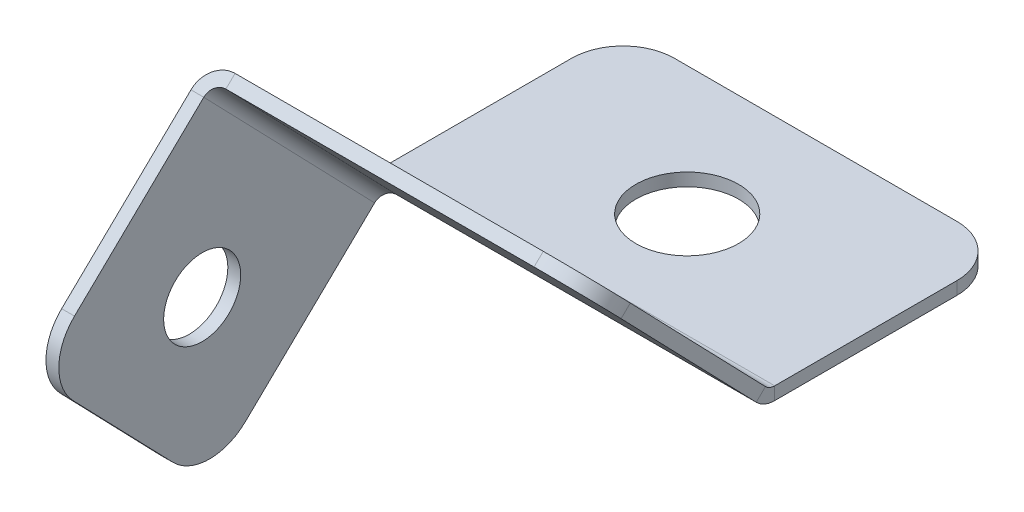
ISO-10303-21;
HEADER;
FILE_DESCRIPTION(('STEP AP214'),'2;1');
FILE_NAME('part.step','',(''),(''),'','','');
FILE_SCHEMA(('AUTOMOTIVE_DESIGN { 1 0 10303 214 1 1 1 1 }'));
ENDSEC;
DATA;
#1=APPLICATION_CONTEXT('core data for automotive mechanical design processes');
#2=APPLICATION_PROTOCOL_DEFINITION('international standard','automotive_design',2000,#1);
#3=PRODUCT_CONTEXT('',#1,'mechanical');
#4=PRODUCT('Part','Part','',(#3));
#5=PRODUCT_RELATED_PRODUCT_CATEGORY('part','',(#4));
#6=PRODUCT_DEFINITION_FORMATION('','',#4);
#7=PRODUCT_DEFINITION_CONTEXT('part definition',#1,'design');
#8=PRODUCT_DEFINITION('design','',#6,#7);
#9=PRODUCT_DEFINITION_SHAPE('','',#8);
#10=(LENGTH_UNIT() NAMED_UNIT(*) SI_UNIT(.MILLI.,.METRE.));
#11=(NAMED_UNIT(*) PLANE_ANGLE_UNIT() SI_UNIT($,.RADIAN.));
#12=(NAMED_UNIT(*) SI_UNIT($,.STERADIAN.) SOLID_ANGLE_UNIT());
#13=UNCERTAINTY_MEASURE_WITH_UNIT(LENGTH_MEASURE(1.E-05),#10,'distance_accuracy_value','');
#14=(GEOMETRIC_REPRESENTATION_CONTEXT(3) GLOBAL_UNCERTAINTY_ASSIGNED_CONTEXT((#13)) GLOBAL_UNIT_ASSIGNED_CONTEXT((#10,
#11,#12)) REPRESENTATION_CONTEXT('',''));
#15=CARTESIAN_POINT('',(0.,0.,0.));
#16=DIRECTION('',(0.,0.,1.));
#17=DIRECTION('',(1.,0.,0.));
#18=AXIS2_PLACEMENT_3D('',#15,#16,#17);
#19=CARTESIAN_POINT('',(-7.5,0.305341629540997,4.8120205967255));
#20=DIRECTION('',(0.,0.719339800338647,0.694658370459001));
#21=DIRECTION('',(0.,-0.694658370459001,0.719339800338647));
#22=AXIS2_PLACEMENT_3D('',#19,#20,#21);
#23=PLANE('',#22);
#24=DIRECTION('',(1.,0.,0.));
#25=VECTOR('',#24,1.);
#26=CARTESIAN_POINT('',(-7.5,0.305341629540997,4.8120205967255));
#27=LINE('',#26,#25);
#28=CARTESIAN_POINT('',(-7.5,0.305341629540997,4.8120205967255));
#29=VERTEX_POINT('',#28);
#30=CARTESIAN_POINT('',(-7.36602540378444,0.305341629540997,4.8120205967255));
#31=VERTEX_POINT('',#30);
#32=EDGE_CURVE('E277',#29,#31,#27,.T.);
#33=ORIENTED_EDGE('',*,*,#32,.T.);
#34=CARTESIAN_POINT('',(-6.5,-0.0419875556885054,5.17169049689483));
#35=DIRECTION('',(0.,-0.719339800338648,-0.694658370459001));
#36=DIRECTION('',(0.,0.694658370459001,-0.719339800338648));
#37=AXIS2_PLACEMENT_3D('',#34,#35,#36);
#38=CIRCLE('',#37,1.);
#39=CARTESIAN_POINT('',(-6.5,0.652670814770498,4.45235069655618));
#40=VERTEX_POINT('',#39);
#41=EDGE_CURVE('E216',#31,#40,#38,.T.);
#42=ORIENTED_EDGE('',*,*,#41,.T.);
#43=DIRECTION('',(1.,0.,0.));
#44=VECTOR('',#43,1.);
#45=CARTESIAN_POINT('',(-7.5,0.652670814770498,4.45235069655618));
#46=LINE('',#45,#44);
#47=CARTESIAN_POINT('',(-7.5,0.652670814770498,4.45235069655618));
#48=VERTEX_POINT('',#47);
#49=EDGE_CURVE('E297',#48,#40,#46,.T.);
#50=ORIENTED_EDGE('',*,*,#49,.F.);
#51=DIRECTION('',(0.,0.694658370459001,-0.719339800338647));
#52=VECTOR('',#51,1.);
#53=CARTESIAN_POINT('',(-7.5,0.305341629540998,4.8120205967255));
#54=LINE('',#53,#52);
#55=EDGE_CURVE('E280',#48,#29,#54,.F.);
#56=ORIENTED_EDGE('',*,*,#55,.T.);
#57=EDGE_LOOP('',(#33,#42,#50,#56));
#58=FACE_BOUND('',#57,.T.);
#59=ADVANCED_FACE('F79',(#58),#23,.T.);
#60=CARTESIAN_POINT('',(0.,-2.60453112695286,2.00198913966243));
#61=DIRECTION('',(0.,0.694658370459001,-0.719339800338647));
#62=DIRECTION('',(0.,0.719339800338647,0.694658370459001));
#63=AXIS2_PLACEMENT_3D('',#60,#61,#62);
#64=PLANE('',#63);
#65=DIRECTION('',(0.,0.719339800338647,0.694658370459001));
#66=VECTOR('',#65,1.);
#67=CARTESIAN_POINT('',(7.5,-2.60453112695286,2.00198913966243));
#68=LINE('',#67,#66);
#69=CARTESIAN_POINT('',(7.5,0.305341629540999,4.8120205967255));
#70=VERTEX_POINT('',#69);
#71=CARTESIAN_POINT('',(7.5,5.75471840270918,10.0744225762685));
#72=VERTEX_POINT('',#71);
#73=EDGE_CURVE('E284',#70,#72,#68,.T.);
#74=ORIENTED_EDGE('',*,*,#73,.T.);
#75=CARTESIAN_POINT('',(5.5,5.75471840270918,10.0744225762685));
#76=DIRECTION('',(0.,0.694658370459001,-0.719339800338647));
#77=DIRECTION('',(0.,0.719339800338647,0.694658370459001));
#78=AXIS2_PLACEMENT_3D('',#75,#76,#77);
#79=CIRCLE('',#78,2.);
#80=CARTESIAN_POINT('',(5.5,7.19339800338647,11.4637393171865));
#81=VERTEX_POINT('',#80);
#82=EDGE_CURVE('E353',#72,#81,#79,.F.);
#83=ORIENTED_EDGE('',*,*,#82,.T.);
#84=DIRECTION('',(-1.,0.,0.));
#85=VECTOR('',#84,1.);
#86=CARTESIAN_POINT('',(0.,7.19339800338647,11.4637393171865));
#87=LINE('',#86,#85);
#88=CARTESIAN_POINT('',(-6.5,7.19339800338647,11.4637393171865));
#89=VERTEX_POINT('',#88);
#90=EDGE_CURVE('E281',#81,#89,#87,.T.);
#91=ORIENTED_EDGE('',*,*,#90,.T.);
#92=DIRECTION('',(0.,-0.719339800338648,-0.694658370459001));
#93=VECTOR('',#92,1.);
#94=CARTESIAN_POINT('',(-6.5,0.305341629540994,4.8120205967255));
#95=LINE('',#94,#93);
#96=CARTESIAN_POINT('',(-6.5,0.305341629540995,4.8120205967255));
#97=VERTEX_POINT('',#96);
#98=EDGE_CURVE('E270',#97,#89,#95,.F.);
#99=ORIENTED_EDGE('',*,*,#98,.F.);
#100=DIRECTION('',(1.,0.,0.));
#101=VECTOR('',#100,1.);
#102=CARTESIAN_POINT('',(-7.5,0.305341629540998,4.8120205967255));
#103=LINE('',#102,#101);
#104=EDGE_CURVE('E292',#70,#97,#103,.F.);
#105=ORIENTED_EDGE('',*,*,#104,.F.);
#106=EDGE_LOOP('',(#74,#83,#91,#99,#105));
#107=FACE_BOUND('',#106,.T.);
#108=ADVANCED_FACE('F434',(#107),#64,.F.);
#109=CARTESIAN_POINT('',(0.,-2.25720194172336,1.64231923949311));
#110=DIRECTION('',(0.,0.694658370459001,-0.719339800338647));
#111=DIRECTION('',(0.,0.719339800338647,0.694658370459001));
#112=AXIS2_PLACEMENT_3D('',#109,#110,#111);
#113=PLANE('',#112);
#114=DIRECTION('',(1.,0.,0.));
#115=VECTOR('',#114,1.);
#116=CARTESIAN_POINT('',(-7.5,7.54072718861597,11.1040694170171));
#117=LINE('',#116,#115);
#118=CARTESIAN_POINT('',(5.5,7.54072718861597,11.1040694170171));
#119=VERTEX_POINT('',#118);
#120=CARTESIAN_POINT('',(-6.5,7.54072718861598,11.1040694170171));
#121=VERTEX_POINT('',#120);
#122=EDGE_CURVE('E287',#119,#121,#117,.F.);
#123=ORIENTED_EDGE('',*,*,#122,.F.);
#124=CARTESIAN_POINT('',(5.5,6.10204758793868,9.71475267609915));
#125=DIRECTION('',(0.,0.694658370459001,-0.719339800338647));
#126=DIRECTION('',(0.,0.719339800338647,0.694658370459001));
#127=AXIS2_PLACEMENT_3D('',#124,#125,#126);
#128=CIRCLE('',#127,2.);
#129=CARTESIAN_POINT('',(7.5,6.10204758793868,9.71475267609915));
#130=VERTEX_POINT('',#129);
#131=EDGE_CURVE('E349',#119,#130,#128,.T.);
#132=ORIENTED_EDGE('',*,*,#131,.T.);
#133=DIRECTION('',(0.,-0.719339800338647,-0.694658370459001));
#134=VECTOR('',#133,1.);
#135=CARTESIAN_POINT('',(7.5,7.54072718861597,11.1040694170171));
#136=LINE('',#135,#134);
#137=CARTESIAN_POINT('',(7.5,0.652670814770501,4.45235069655618));
#138=VERTEX_POINT('',#137);
#139=EDGE_CURVE('E289',#138,#130,#136,.F.);
#140=ORIENTED_EDGE('',*,*,#139,.F.);
#141=EDGE_CURVE('E300',#40,#138,#46,.T.);
#142=ORIENTED_EDGE('',*,*,#141,.F.);
#143=DIRECTION('',(0.,-0.719339800338648,-0.694658370459001));
#144=VECTOR('',#143,1.);
#145=CARTESIAN_POINT('',(-6.5,0.652670814770495,4.45235069655618));
#146=LINE('',#145,#144);
#147=EDGE_CURVE('E219',#40,#121,#146,.F.);
#148=ORIENTED_EDGE('',*,*,#147,.T.);
#149=EDGE_LOOP('',(#123,#132,#140,#142,#148));
#150=FACE_BOUND('',#149,.T.);
#151=ADVANCED_FACE('F417',(#150),#113,.T.);
#152=CARTESIAN_POINT('',(-7.5,7.19339800338647,11.4637393171865));
#153=DIRECTION('',(0.,-0.719339800338647,-0.694658370459001));
#154=DIRECTION('',(0.,0.694658370459001,-0.719339800338647));
#155=AXIS2_PLACEMENT_3D('',#152,#153,#154);
#156=PLANE('',#155);
#157=ORIENTED_EDGE('',*,*,#90,.F.);
#158=DIRECTION('',(0.,0.694658370459001,-0.719339800338647));
#159=VECTOR('',#158,1.);
#160=CARTESIAN_POINT('',(5.5,7.19339800338647,11.4637393171865));
#161=LINE('',#160,#159);
#162=EDGE_CURVE('E346',#81,#119,#161,.T.);
#163=ORIENTED_EDGE('',*,*,#162,.T.);
#164=ORIENTED_EDGE('',*,*,#122,.T.);
#165=DIRECTION('',(0.,0.694658370459,-0.719339800338648));
#166=VECTOR('',#165,1.);
#167=CARTESIAN_POINT('',(-6.5,7.19339800338648,11.4637393171865));
#168=LINE('',#167,#166);
#169=EDGE_CURVE('E266',#89,#121,#168,.T.);
#170=ORIENTED_EDGE('',*,*,#169,.F.);
#171=EDGE_LOOP('',(#157,#163,#164,#170));
#172=FACE_BOUND('',#171,.T.);
#173=ADVANCED_FACE('F426',(#172),#156,.F.);
#174=CARTESIAN_POINT('',(7.5,0.5,-5.));
#175=DIRECTION('',(1.,0.,0.));
#176=DIRECTION('',(0.,0.,-1.));
#177=AXIS2_PLACEMENT_3D('',#174,#175,#176);
#178=PLANE('',#177);
#179=DIRECTION('',(0.,0.,1.));
#180=VECTOR('',#179,1.);
#181=CARTESIAN_POINT('',(7.5,0.,0.));
#182=LINE('',#181,#180);
#183=CARTESIAN_POINT('',(7.5,0.,4.09268079638686));
#184=VERTEX_POINT('',#183);
#185=CARTESIAN_POINT('',(7.5,0.,-3.));
#186=VERTEX_POINT('',#185);
#187=EDGE_CURVE('E324',#184,#186,#182,.F.);
#188=ORIENTED_EDGE('',*,*,#187,.T.);
#189=DIRECTION('',(0.,1.,0.));
#190=VECTOR('',#189,1.);
#191=CARTESIAN_POINT('',(7.5,0.5,-3.));
#192=LINE('',#191,#190);
#193=CARTESIAN_POINT('',(7.5,0.5,-3.));
#194=VERTEX_POINT('',#193);
#195=EDGE_CURVE('E372',#186,#194,#192,.T.);
#196=ORIENTED_EDGE('',*,*,#195,.T.);
#197=DIRECTION('',(0.,0.,-1.));
#198=VECTOR('',#197,1.);
#199=CARTESIAN_POINT('',(7.5,0.5,-5.));
#200=LINE('',#199,#198);
#201=CARTESIAN_POINT('',(7.5,0.5,4.09268079638686));
#202=VERTEX_POINT('',#201);
#203=EDGE_CURVE('E326',#202,#194,#200,.T.);
#204=ORIENTED_EDGE('',*,*,#203,.F.);
#205=DIRECTION('',(0.,-1.,0.));
#206=VECTOR('',#205,1.);
#207=CARTESIAN_POINT('',(7.5,0.500000000000002,4.09268079638686));
#208=LINE('',#207,#206);
#209=EDGE_CURVE('E310',#202,#184,#208,.T.);
#210=ORIENTED_EDGE('',*,*,#209,.T.);
#211=EDGE_LOOP('',(#188,#196,#204,#210));
#212=FACE_BOUND('',#211,.T.);
#213=ADVANCED_FACE('F392',(#212),#178,.T.);
#214=CARTESIAN_POINT('',(0.,0.5,0.));
#215=DIRECTION('',(0.,1.,0.));
#216=DIRECTION('',(0.,0.,1.));
#217=AXIS2_PLACEMENT_3D('',#214,#215,#216);
#218=PLANE('',#217);
#219=CARTESIAN_POINT('',(0.,0.5,0.));
#220=DIRECTION('',(0.,1.,0.));
#221=DIRECTION('',(0.,0.,1.));
#222=AXIS2_PLACEMENT_3D('',#219,#220,#221);
#223=CIRCLE('',#222,2.);
#224=CARTESIAN_POINT('',(0.,0.5,2.));
#225=VERTEX_POINT('',#224);
#226=EDGE_CURVE('E335',#225,#225,#223,.T.);
#227=ORIENTED_EDGE('',*,*,#226,.F.);
#228=EDGE_LOOP('',(#227));
#229=FACE_BOUND('',#228,.T.);
#230=ORIENTED_EDGE('',*,*,#203,.T.);
#231=CARTESIAN_POINT('',(5.5,0.5,-3.));
#232=DIRECTION('',(0.,1.,0.));
#233=DIRECTION('',(0.,0.,1.));
#234=AXIS2_PLACEMENT_3D('',#231,#232,#233);
#235=CIRCLE('',#234,2.);
#236=CARTESIAN_POINT('',(5.49999999999999,0.5,-5.));
#237=VERTEX_POINT('',#236);
#238=EDGE_CURVE('E377',#194,#237,#235,.T.);
#239=ORIENTED_EDGE('',*,*,#238,.T.);
#240=DIRECTION('',(-1.,0.,0.));
#241=VECTOR('',#240,1.);
#242=CARTESIAN_POINT('',(-7.5,0.5,-5.));
#243=LINE('',#242,#241);
#244=CARTESIAN_POINT('',(-5.5,0.5,-5.));
#245=VERTEX_POINT('',#244);
#246=EDGE_CURVE('E329',#237,#245,#243,.T.);
#247=ORIENTED_EDGE('',*,*,#246,.T.);
#248=CARTESIAN_POINT('',(-5.5,0.5,-3.));
#249=DIRECTION('',(0.,1.,0.));
#250=DIRECTION('',(0.,0.,1.));
#251=AXIS2_PLACEMENT_3D('',#248,#249,#250);
#252=CIRCLE('',#251,2.);
#253=CARTESIAN_POINT('',(-7.5,0.5,-3.));
#254=VERTEX_POINT('',#253);
#255=EDGE_CURVE('E375',#245,#254,#252,.T.);
#256=ORIENTED_EDGE('',*,*,#255,.T.);
#257=DIRECTION('',(0.,0.,1.));
#258=VECTOR('',#257,1.);
#259=CARTESIAN_POINT('',(-7.5,0.5,-5.));
#260=LINE('',#259,#258);
#261=CARTESIAN_POINT('',(-7.5,0.5,4.09268079638686));
#262=VERTEX_POINT('',#261);
#263=EDGE_CURVE('E333',#254,#262,#260,.T.);
#264=ORIENTED_EDGE('',*,*,#263,.T.);
#265=DIRECTION('',(1.,0.,0.));
#266=VECTOR('',#265,1.);
#267=CARTESIAN_POINT('',(7.5,0.500000000000002,4.09268079638686));
#268=LINE('',#267,#266);
#269=EDGE_CURVE('E316',#202,#262,#268,.F.);
#270=ORIENTED_EDGE('',*,*,#269,.F.);
#271=EDGE_LOOP('',(#230,#239,#247,#256,#264,#270));
#272=FACE_BOUND('',#271,.T.);
#273=ADVANCED_FACE('F398',(#229,#272),#218,.T.);
#274=CARTESIAN_POINT('',(0.,0.,0.));
#275=DIRECTION('',(0.,1.,0.));
#276=DIRECTION('',(0.,0.,1.));
#277=AXIS2_PLACEMENT_3D('',#274,#275,#276);
#278=PLANE('',#277);
#279=CARTESIAN_POINT('',(0.,0.,0.));
#280=DIRECTION('',(0.,1.,0.));
#281=DIRECTION('',(0.,0.,1.));
#282=AXIS2_PLACEMENT_3D('',#279,#280,#281);
#283=CIRCLE('',#282,2.);
#284=CARTESIAN_POINT('',(0.,0.,2.));
#285=VERTEX_POINT('',#284);
#286=EDGE_CURVE('E330',#285,#285,#283,.T.);
#287=ORIENTED_EDGE('',*,*,#286,.T.);
#288=EDGE_LOOP('',(#287));
#289=FACE_BOUND('',#288,.T.);
#290=DIRECTION('',(1.,0.,0.));
#291=VECTOR('',#290,1.);
#292=CARTESIAN_POINT('',(0.,0.,-5.));
#293=LINE('',#292,#291);
#294=CARTESIAN_POINT('',(5.5,0.,-5.));
#295=VERTEX_POINT('',#294);
#296=CARTESIAN_POINT('',(-5.5,0.,-5.));
#297=VERTEX_POINT('',#296);
#298=EDGE_CURVE('E340',#295,#297,#293,.F.);
#299=ORIENTED_EDGE('',*,*,#298,.F.);
#300=CARTESIAN_POINT('',(5.5,0.,-3.));
#301=DIRECTION('',(0.,1.,0.));
#302=DIRECTION('',(0.,0.,1.));
#303=AXIS2_PLACEMENT_3D('',#300,#301,#302);
#304=CIRCLE('',#303,2.);
#305=EDGE_CURVE('E87',#295,#186,#304,.F.);
#306=ORIENTED_EDGE('',*,*,#305,.T.);
#307=ORIENTED_EDGE('',*,*,#187,.F.);
#308=DIRECTION('',(1.,0.,0.));
#309=VECTOR('',#308,1.);
#310=CARTESIAN_POINT('',(7.5,0.,4.09268079638686));
#311=LINE('',#310,#309);
#312=CARTESIAN_POINT('',(-7.5,0.,4.09268079638686));
#313=VERTEX_POINT('',#312);
#314=EDGE_CURVE('E303',#184,#313,#311,.F.);
#315=ORIENTED_EDGE('',*,*,#314,.T.);
#316=DIRECTION('',(0.,0.,1.));
#317=VECTOR('',#316,1.);
#318=CARTESIAN_POINT('',(-7.5,0.,0.));
#319=LINE('',#318,#317);
#320=CARTESIAN_POINT('',(-7.5,0.,-3.));
#321=VERTEX_POINT('',#320);
#322=EDGE_CURVE('E341',#321,#313,#319,.T.);
#323=ORIENTED_EDGE('',*,*,#322,.F.);
#324=CARTESIAN_POINT('',(-5.5,0.,-3.));
#325=DIRECTION('',(0.,1.,0.));
#326=DIRECTION('',(0.,0.,1.));
#327=AXIS2_PLACEMENT_3D('',#324,#325,#326);
#328=CIRCLE('',#327,2.);
#329=EDGE_CURVE('E99',#321,#297,#328,.F.);
#330=ORIENTED_EDGE('',*,*,#329,.T.);
#331=EDGE_LOOP('',(#299,#306,#307,#315,#323,#330));
#332=FACE_BOUND('',#331,.T.);
#333=ADVANCED_FACE('F386',(#289,#332),#278,.F.);
#334=CARTESIAN_POINT('',(-7.5,0.5,-5.));
#335=DIRECTION('',(-1.,0.,0.));
#336=DIRECTION('',(0.,0.,1.));
#337=AXIS2_PLACEMENT_3D('',#334,#335,#336);
#338=PLANE('',#337);
#339=ORIENTED_EDGE('',*,*,#263,.F.);
#340=DIRECTION('',(0.,1.,0.));
#341=VECTOR('',#340,1.);
#342=CARTESIAN_POINT('',(-7.5,0.5,-3.));
#343=LINE('',#342,#341);
#344=EDGE_CURVE('E13',#254,#321,#343,.F.);
#345=ORIENTED_EDGE('',*,*,#344,.T.);
#346=ORIENTED_EDGE('',*,*,#322,.T.);
#347=DIRECTION('',(0.,-1.,0.));
#348=VECTOR('',#347,1.);
#349=CARTESIAN_POINT('',(-7.5,0.499999999999999,4.09268079638686));
#350=LINE('',#349,#348);
#351=EDGE_CURVE('E321',#262,#313,#350,.T.);
#352=ORIENTED_EDGE('',*,*,#351,.F.);
#353=EDGE_LOOP('',(#339,#345,#346,#352));
#354=FACE_BOUND('',#353,.T.);
#355=ADVANCED_FACE('F404',(#354),#338,.T.);
#356=CARTESIAN_POINT('',(-7.5,0.5,-5.));
#357=DIRECTION('',(0.,0.,-1.));
#358=DIRECTION('',(-1.,0.,0.));
#359=AXIS2_PLACEMENT_3D('',#356,#357,#358);
#360=PLANE('',#359);
#361=ORIENTED_EDGE('',*,*,#246,.F.);
#362=DIRECTION('',(0.,1.,0.));
#363=VECTOR('',#362,1.);
#364=CARTESIAN_POINT('',(5.5,0.5,-5.));
#365=LINE('',#364,#363);
#366=EDGE_CURVE('E382',#237,#295,#365,.F.);
#367=ORIENTED_EDGE('',*,*,#366,.T.);
#368=ORIENTED_EDGE('',*,*,#298,.T.);
#369=DIRECTION('',(0.,1.,0.));
#370=VECTOR('',#369,1.);
#371=CARTESIAN_POINT('',(-5.5,0.5,-5.));
#372=LINE('',#371,#370);
#373=EDGE_CURVE('E379',#297,#245,#372,.T.);
#374=ORIENTED_EDGE('',*,*,#373,.T.);
#375=EDGE_LOOP('',(#361,#367,#368,#374));
#376=FACE_BOUND('',#375,.T.);
#377=ADVANCED_FACE('F400',(#376),#360,.T.);
#378=CARTESIAN_POINT('',(0.,0.5,0.));
#379=DIRECTION('',(0.,1.,0.));
#380=DIRECTION('',(0.,0.,1.));
#381=AXIS2_PLACEMENT_3D('',#378,#379,#380);
#382=CYLINDRICAL_SURFACE('',#381,2.);
#383=ORIENTED_EDGE('',*,*,#226,.T.);
#384=EDGE_LOOP('',(#383));
#385=FACE_BOUND('',#384,.T.);
#386=ORIENTED_EDGE('',*,*,#286,.F.);
#387=EDGE_LOOP('',(#386));
#388=FACE_BOUND('',#387,.T.);
#389=ADVANCED_FACE('F484',(#385,#388),#382,.F.);
#390=CARTESIAN_POINT('',(-7.5,0.999999999999998,4.09268079638686));
#391=DIRECTION('',(-1.,0.,0.));
#392=DIRECTION('',(0.,-1.,0.));
#393=AXIS2_PLACEMENT_3D('',#390,#391,#392);
#394=PLANE('',#393);
#395=ORIENTED_EDGE('',*,*,#55,.F.);
#396=CARTESIAN_POINT('',(-7.5,0.999999999999998,4.09268079638686));
#397=DIRECTION('',(1.,0.,0.));
#398=DIRECTION('',(0.,1.,0.));
#399=AXIS2_PLACEMENT_3D('',#396,#397,#398);
#400=CIRCLE('',#399,0.499999999999999);
#401=EDGE_CURVE('E313',#262,#48,#400,.F.);
#402=ORIENTED_EDGE('',*,*,#401,.F.);
#403=ORIENTED_EDGE('',*,*,#351,.T.);
#404=CARTESIAN_POINT('',(-7.5,0.999999999999998,4.09268079638686));
#405=DIRECTION('',(1.,0.,0.));
#406=DIRECTION('',(0.,1.,0.));
#407=AXIS2_PLACEMENT_3D('',#404,#405,#406);
#408=CIRCLE('',#407,0.999999999999999);
#409=EDGE_CURVE('E306',#313,#29,#408,.F.);
#410=ORIENTED_EDGE('',*,*,#409,.T.);
#411=EDGE_LOOP('',(#395,#402,#403,#410));
#412=FACE_BOUND('',#411,.T.);
#413=ADVANCED_FACE('F412',(#412),#394,.T.);
#414=CARTESIAN_POINT('',(7.5,1.,4.09268079638686));
#415=DIRECTION('',(-1.,0.,0.));
#416=DIRECTION('',(0.,-1.,0.));
#417=AXIS2_PLACEMENT_3D('',#414,#415,#416);
#418=PLANE('',#417);
#419=CARTESIAN_POINT('',(7.5,1.,4.09268079638686));
#420=DIRECTION('',(1.,0.,0.));
#421=DIRECTION('',(0.,1.,0.));
#422=AXIS2_PLACEMENT_3D('',#419,#420,#421);
#423=CIRCLE('',#422,0.499999999999999);
#424=EDGE_CURVE('E283',#138,#202,#423,.T.);
#425=ORIENTED_EDGE('',*,*,#424,.F.);
#426=DIRECTION('',(0.,0.694658370459001,-0.719339800338647));
#427=VECTOR('',#426,1.);
#428=CARTESIAN_POINT('',(7.5,0.652670814770499,4.45235069655618));
#429=LINE('',#428,#427);
#430=EDGE_CURVE('E294',#138,#70,#429,.F.);
#431=ORIENTED_EDGE('',*,*,#430,.T.);
#432=CARTESIAN_POINT('',(7.5,1.,4.09268079638686));
#433=DIRECTION('',(1.,0.,0.));
#434=DIRECTION('',(0.,1.,0.));
#435=AXIS2_PLACEMENT_3D('',#432,#433,#434);
#436=CIRCLE('',#435,0.999999999999999);
#437=EDGE_CURVE('E307',#70,#184,#436,.T.);
#438=ORIENTED_EDGE('',*,*,#437,.T.);
#439=ORIENTED_EDGE('',*,*,#209,.F.);
#440=EDGE_LOOP('',(#425,#431,#438,#439));
#441=FACE_BOUND('',#440,.T.);
#442=ADVANCED_FACE('F440',(#441),#418,.F.);
#443=CARTESIAN_POINT('',(7.5,1.,4.09268079638686));
#444=DIRECTION('',(1.,0.,0.));
#445=DIRECTION('',(0.,-0.694658370459001,0.719339800338647));
#446=AXIS2_PLACEMENT_3D('',#443,#444,#445);
#447=CYLINDRICAL_SURFACE('',#446,0.999999999999999);
#448=ORIENTED_EDGE('',*,*,#314,.F.);
#449=ORIENTED_EDGE('',*,*,#437,.F.);
#450=ORIENTED_EDGE('',*,*,#104,.T.);
#451=EDGE_CURVE('E276',#31,#97,#27,.T.);
#452=ORIENTED_EDGE('',*,*,#451,.F.);
#453=ORIENTED_EDGE('',*,*,#32,.F.);
#454=ORIENTED_EDGE('',*,*,#409,.F.);
#455=EDGE_LOOP('',(#448,#449,#450,#452,#453,#454));
#456=FACE_BOUND('',#455,.T.);
#457=ADVANCED_FACE('F437',(#456),#447,.T.);
#458=CARTESIAN_POINT('',(7.5,1.,4.09268079638686));
#459=DIRECTION('',(1.,0.,0.));
#460=DIRECTION('',(0.,-0.694658370459001,0.719339800338647));
#461=AXIS2_PLACEMENT_3D('',#458,#459,#460);
#462=CYLINDRICAL_SURFACE('',#461,0.499999999999999);
#463=ORIENTED_EDGE('',*,*,#269,.T.);
#464=ORIENTED_EDGE('',*,*,#401,.T.);
#465=ORIENTED_EDGE('',*,*,#49,.T.);
#466=ORIENTED_EDGE('',*,*,#141,.T.);
#467=ORIENTED_EDGE('',*,*,#424,.T.);
#468=EDGE_LOOP('',(#463,#464,#465,#466,#467));
#469=FACE_BOUND('',#468,.T.);
#470=ADVANCED_FACE('F409',(#469),#462,.F.);
#471=CARTESIAN_POINT('',(7.5,7.19339800338647,11.4637393171865));
#472=DIRECTION('',(-1.,0.,0.));
#473=DIRECTION('',(0.,-1.,0.));
#474=AXIS2_PLACEMENT_3D('',#471,#472,#473);
#475=PLANE('',#474);
#476=ORIENTED_EDGE('',*,*,#139,.T.);
#477=DIRECTION('',(0.,0.694658370459001,-0.719339800338647));
#478=VECTOR('',#477,1.);
#479=CARTESIAN_POINT('',(7.5,5.75471840270918,10.0744225762685));
#480=LINE('',#479,#478);
#481=EDGE_CURVE('E351',#130,#72,#480,.F.);
#482=ORIENTED_EDGE('',*,*,#481,.T.);
#483=ORIENTED_EDGE('',*,*,#73,.F.);
#484=ORIENTED_EDGE('',*,*,#430,.F.);
#485=EDGE_LOOP('',(#476,#482,#483,#484));
#486=FACE_BOUND('',#485,.T.);
#487=ADVANCED_FACE('F442',(#486),#475,.F.);
#488=CARTESIAN_POINT('',(-6.5,6.84606881815698,11.8234092173558));
#489=DIRECTION('',(0.,0.719339800338648,0.694658370459001));
#490=DIRECTION('',(0.,-0.694658370459001,0.719339800338648));
#491=AXIS2_PLACEMENT_3D('',#488,#489,#490);
#492=PLANE('',#491);
#493=DIRECTION('',(1.,0.,0.));
#494=VECTOR('',#493,1.);
#495=CARTESIAN_POINT('',(-7.5,6.84606881815698,11.8234092173558));
#496=LINE('',#495,#494);
#497=CARTESIAN_POINT('',(-7.,6.84606881815698,11.8234092173558));
#498=VERTEX_POINT('',#497);
#499=CARTESIAN_POINT('',(-7.5,6.84606881815698,11.8234092173558));
#500=VERTEX_POINT('',#499);
#501=EDGE_CURVE('E259',#498,#500,#496,.F.);
#502=ORIENTED_EDGE('',*,*,#501,.F.);
#503=CARTESIAN_POINT('',(-6.5,6.84606881815698,11.8234092173558));
#504=DIRECTION('',(0.,-0.719339800338648,-0.694658370459001));
#505=DIRECTION('',(0.,0.694658370459001,-0.719339800338648));
#506=AXIS2_PLACEMENT_3D('',#503,#504,#505);
#507=CIRCLE('',#506,0.5);
#508=EDGE_CURVE('E220',#89,#498,#507,.F.);
#509=ORIENTED_EDGE('',*,*,#508,.F.);
#510=ORIENTED_EDGE('',*,*,#169,.T.);
#511=CARTESIAN_POINT('',(-6.5,6.84606881815698,11.8234092173558));
#512=DIRECTION('',(0.,-0.719339800338648,-0.694658370459001));
#513=DIRECTION('',(0.,0.694658370459001,-0.719339800338648));
#514=AXIS2_PLACEMENT_3D('',#511,#512,#513);
#515=CIRCLE('',#514,1.);
#516=EDGE_CURVE('E265',#121,#500,#515,.F.);
#517=ORIENTED_EDGE('',*,*,#516,.T.);
#518=EDGE_LOOP('',(#502,#509,#510,#517));
#519=FACE_BOUND('',#518,.T.);
#520=ADVANCED_FACE('F423',(#519),#492,.T.);
#521=CARTESIAN_POINT('',(-6.5,-0.0419875556885057,5.17169049689483));
#522=DIRECTION('',(0.,0.719339800338648,0.694658370459001));
#523=DIRECTION('',(0.,-0.694658370459001,0.719339800338648));
#524=AXIS2_PLACEMENT_3D('',#521,#522,#523);
#525=PLANE('',#524);
#526=CARTESIAN_POINT('',(-7.5,-0.0419875556885014,5.17169049689482));
#527=VERTEX_POINT('',#526);
#528=EDGE_CURVE('E208',#527,#31,#38,.T.);
#529=ORIENTED_EDGE('',*,*,#528,.T.);
#530=ORIENTED_EDGE('',*,*,#451,.T.);
#531=CARTESIAN_POINT('',(-6.5,-0.0419875556885057,5.17169049689483));
#532=DIRECTION('',(0.,-0.719339800338648,-0.694658370459001));
#533=DIRECTION('',(0.,0.694658370459001,-0.719339800338648));
#534=AXIS2_PLACEMENT_3D('',#531,#532,#533);
#535=CIRCLE('',#534,0.5);
#536=CARTESIAN_POINT('',(-7.,-0.0419875556885046,5.17169049689483));
#537=VERTEX_POINT('',#536);
#538=EDGE_CURVE('E227',#537,#97,#535,.T.);
#539=ORIENTED_EDGE('',*,*,#538,.F.);
#540=DIRECTION('',(1.,0.,0.));
#541=VECTOR('',#540,1.);
#542=CARTESIAN_POINT('',(-7.,-0.0419875556885024,5.17169049689482));
#543=LINE('',#542,#541);
#544=EDGE_CURVE('E224',#537,#527,#543,.F.);
#545=ORIENTED_EDGE('',*,*,#544,.T.);
#546=EDGE_LOOP('',(#529,#530,#539,#545));
#547=FACE_BOUND('',#546,.T.);
#548=ADVANCED_FACE('F225',(#547),#525,.F.);
#549=CARTESIAN_POINT('',(-6.5,-0.0419875556885063,5.17169049689483));
#550=DIRECTION('',(0.,-0.719339800338648,-0.694658370459001));
#551=DIRECTION('',(-1.,0.,0.));
#552=AXIS2_PLACEMENT_3D('',#549,#550,#551);
#553=CYLINDRICAL_SURFACE('',#552,1.);
#554=ORIENTED_EDGE('',*,*,#147,.F.);
#555=ORIENTED_EDGE('',*,*,#41,.F.);
#556=ORIENTED_EDGE('',*,*,#528,.F.);
#557=DIRECTION('',(0.,-0.719339800338647,-0.694658370459001));
#558=VECTOR('',#557,1.);
#559=CARTESIAN_POINT('',(-7.5,6.84606881815698,11.8234092173558));
#560=LINE('',#559,#558);
#561=EDGE_CURVE('E214',#527,#500,#560,.F.);
#562=ORIENTED_EDGE('',*,*,#561,.T.);
#563=ORIENTED_EDGE('',*,*,#516,.F.);
#564=EDGE_LOOP('',(#554,#555,#556,#562,#563));
#565=FACE_BOUND('',#564,.T.);
#566=ADVANCED_FACE('F211',(#565),#553,.T.);
#567=CARTESIAN_POINT('',(-6.5,-0.0419875556885063,5.17169049689483));
#568=DIRECTION('',(0.,-0.719339800338648,-0.694658370459001));
#569=DIRECTION('',(-1.,0.,0.));
#570=AXIS2_PLACEMENT_3D('',#567,#568,#569);
#571=CYLINDRICAL_SURFACE('',#570,0.5);
#572=ORIENTED_EDGE('',*,*,#98,.T.);
#573=ORIENTED_EDGE('',*,*,#508,.T.);
#574=DIRECTION('',(0.,-0.719339800338647,-0.694658370459001));
#575=VECTOR('',#574,1.);
#576=CARTESIAN_POINT('',(-7.,6.84606881815697,11.8234092173558));
#577=LINE('',#576,#575);
#578=EDGE_CURVE('E232',#498,#537,#577,.T.);
#579=ORIENTED_EDGE('',*,*,#578,.T.);
#580=ORIENTED_EDGE('',*,*,#538,.T.);
#581=EDGE_LOOP('',(#572,#573,#579,#580));
#582=FACE_BOUND('',#581,.T.);
#583=ADVANCED_FACE('F430',(#582),#571,.F.);
#584=CARTESIAN_POINT('',(-7.50000000000003,-6.29391288981951,11.6457486999427));
#585=DIRECTION('',(0.,0.719339800338647,0.694658370459001));
#586=DIRECTION('',(0.,-0.694658370459001,0.719339800338647));
#587=AXIS2_PLACEMENT_3D('',#584,#585,#586);
#588=PLANE('',#587);
#589=DIRECTION('',(0.,0.694658370459001,-0.719339800338647));
#590=VECTOR('',#589,1.);
#591=CARTESIAN_POINT('',(-7.00000000000003,-6.29391288981952,11.6457486999427));
#592=LINE('',#591,#590);
#593=CARTESIAN_POINT('',(-7.00000000000002,-4.90459614890151,10.2070690992654));
#594=VERTEX_POINT('',#593);
#595=EDGE_CURVE('E242',#537,#594,#592,.F.);
#596=ORIENTED_EDGE('',*,*,#595,.T.);
#597=DIRECTION('',(1.,0.,0.));
#598=VECTOR('',#597,1.);
#599=CARTESIAN_POINT('',(-7.50000000000002,-4.90459614890151,10.2070690992654));
#600=LINE('',#599,#598);
#601=CARTESIAN_POINT('',(-7.50000000000002,-4.90459614890151,10.2070690992654));
#602=VERTEX_POINT('',#601);
#603=EDGE_CURVE('E246',#594,#602,#600,.F.);
#604=ORIENTED_EDGE('',*,*,#603,.T.);
#605=DIRECTION('',(0.,-0.694658370459001,0.719339800338647));
#606=VECTOR('',#605,1.);
#607=CARTESIAN_POINT('',(-7.49999999999998,2.56254357126438,2.47461956172403));
#608=LINE('',#607,#606);
#609=EDGE_CURVE('E238',#527,#602,#608,.T.);
#610=ORIENTED_EDGE('',*,*,#609,.F.);
#611=ORIENTED_EDGE('',*,*,#544,.F.);
#612=EDGE_LOOP('',(#596,#604,#610,#611));
#613=FACE_BOUND('',#612,.T.);
#614=ADVANCED_FACE('F244',(#613),#588,.F.);
#615=CARTESIAN_POINT('',(-7.5,7.19339800338647,11.4637393171865));
#616=DIRECTION('',(0.,-0.719339800338647,-0.694658370459001));
#617=DIRECTION('',(0.,0.694658370459001,-0.719339800338647));
#618=AXIS2_PLACEMENT_3D('',#615,#616,#617);
#619=PLANE('',#618);
#620=DIRECTION('',(0.,0.694658370459001,-0.719339800338647));
#621=VECTOR('',#620,1.);
#622=CARTESIAN_POINT('',(-7.49999999999998,9.45059994510986,9.126338282185));
#623=LINE('',#622,#621);
#624=CARTESIAN_POINT('',(-7.50000000000002,1.98346022494397,16.8587878197263));
#625=VERTEX_POINT('',#624);
#626=EDGE_CURVE('E241',#625,#500,#623,.T.);
#627=ORIENTED_EDGE('',*,*,#626,.F.);
#628=DIRECTION('',(1.,0.,0.));
#629=VECTOR('',#628,1.);
#630=CARTESIAN_POINT('',(-7.50000000000002,1.98346022494396,16.8587878197263));
#631=LINE('',#630,#629);
#632=CARTESIAN_POINT('',(-7.00000000000002,1.98346022494396,16.8587878197263));
#633=VERTEX_POINT('',#632);
#634=EDGE_CURVE('E355',#625,#633,#631,.T.);
#635=ORIENTED_EDGE('',*,*,#634,.T.);
#636=DIRECTION('',(0.,-0.694658370459001,0.719339800338647));
#637=VECTOR('',#636,1.);
#638=CARTESIAN_POINT('',(-7.,7.19339800338647,11.4637393171865));
#639=LINE('',#638,#637);
#640=EDGE_CURVE('E248',#633,#498,#639,.F.);
#641=ORIENTED_EDGE('',*,*,#640,.T.);
#642=ORIENTED_EDGE('',*,*,#501,.T.);
#643=EDGE_LOOP('',(#627,#635,#641,#642));
#644=FACE_BOUND('',#643,.T.);
#645=ADVANCED_FACE('F632',(#644),#619,.F.);
#646=CARTESIAN_POINT('',(-7.49999999999998,0.,0.));
#647=DIRECTION('',(1.,0.,0.));
#648=DIRECTION('',(0.,0.,-1.));
#649=AXIS2_PLACEMENT_3D('',#646,#647,#648);
#650=PLANE('',#649);
#651=CARTESIAN_POINT('',(-7.50000000000001,0.135900169181718,11.8871231422111));
#652=DIRECTION('',(-1.,0.,0.));
#653=DIRECTION('',(0.,-1.,0.));
#654=AXIS2_PLACEMENT_3D('',#651,#652,#653);
#655=CIRCLE('',#654,1.5);
#656=CARTESIAN_POINT('',(-7.50000000000002,-1.36409983081828,11.8871231422111));
#657=VERTEX_POINT('',#656);
#658=EDGE_CURVE('E722',#657,#657,#655,.T.);
#659=ORIENTED_EDGE('',*,*,#658,.F.);
#660=EDGE_LOOP('',(#659));
#661=FACE_BOUND('',#660,.T.);
#662=DIRECTION('',(0.,0.719339800338647,0.694658370459001));
#663=VECTOR('',#662,1.);
#664=CARTESIAN_POINT('',(-7.50000000000003,-8.85645646108388,9.1711291382186));
#665=LINE('',#664,#663);
#666=CARTESIAN_POINT('',(-7.50000000000003,-4.85523328914222,13.0350654408607));
#667=VERTEX_POINT('',#666);
#668=CARTESIAN_POINT('',(-7.50000000000003,-0.844536116651334,16.9081506794856));
#669=VERTEX_POINT('',#668);
#670=EDGE_CURVE('E247',#667,#669,#665,.T.);
#671=ORIENTED_EDGE('',*,*,#670,.T.);
#672=CARTESIAN_POINT('',(-7.50000000000002,0.54478062426667,15.4694710788083));
#673=DIRECTION('',(1.,0.,0.));
#674=DIRECTION('',(0.,0.,-1.));
#675=AXIS2_PLACEMENT_3D('',#672,#673,#674);
#676=CIRCLE('',#675,2.);
#677=EDGE_CURVE('E369',#669,#625,#676,.F.);
#678=ORIENTED_EDGE('',*,*,#677,.T.);
#679=ORIENTED_EDGE('',*,*,#626,.T.);
#680=ORIENTED_EDGE('',*,*,#561,.F.);
#681=ORIENTED_EDGE('',*,*,#609,.T.);
#682=CARTESIAN_POINT('',(-7.50000000000002,-3.46591654822422,11.5963858401834));
#683=DIRECTION('',(1.,0.,0.));
#684=DIRECTION('',(0.,0.,-1.));
#685=AXIS2_PLACEMENT_3D('',#682,#683,#684);
#686=CIRCLE('',#685,2.);
#687=EDGE_CURVE('E367',#602,#667,#686,.F.);
#688=ORIENTED_EDGE('',*,*,#687,.T.);
#689=EDGE_LOOP('',(#671,#678,#679,#680,#681,#688));
#690=FACE_BOUND('',#689,.T.);
#691=ADVANCED_FACE('F237',(#661,#690),#650,.F.);
#692=CARTESIAN_POINT('',(-6.99999999999999,0.,0.));
#693=DIRECTION('',(1.,0.,0.));
#694=DIRECTION('',(0.,0.,-1.));
#695=AXIS2_PLACEMENT_3D('',#692,#693,#694);
#696=PLANE('',#695);
#697=CARTESIAN_POINT('',(-7.00000000000001,0.135900169181717,11.8871231422111));
#698=DIRECTION('',(-1.,0.,0.));
#699=DIRECTION('',(0.,-1.,0.));
#700=AXIS2_PLACEMENT_3D('',#697,#698,#699);
#701=CIRCLE('',#700,1.5);
#702=CARTESIAN_POINT('',(-7.00000000000002,-1.36409983081829,11.8871231422111));
#703=VERTEX_POINT('',#702);
#704=EDGE_CURVE('E262',#703,#703,#701,.T.);
#705=ORIENTED_EDGE('',*,*,#704,.T.);
#706=EDGE_LOOP('',(#705));
#707=FACE_BOUND('',#706,.T.);
#708=ORIENTED_EDGE('',*,*,#640,.F.);
#709=CARTESIAN_POINT('',(-7.00000000000002,0.544780624266668,15.4694710788083));
#710=DIRECTION('',(1.,0.,0.));
#711=DIRECTION('',(0.,0.,-1.));
#712=AXIS2_PLACEMENT_3D('',#709,#710,#711);
#713=CIRCLE('',#712,2.);
#714=CARTESIAN_POINT('',(-7.00000000000003,-0.844536116651335,16.9081506794856));
#715=VERTEX_POINT('',#714);
#716=EDGE_CURVE('E360',#633,#715,#713,.T.);
#717=ORIENTED_EDGE('',*,*,#716,.T.);
#718=DIRECTION('',(0.,-0.719339800338647,-0.694658370459001));
#719=VECTOR('',#718,1.);
#720=CARTESIAN_POINT('',(-7.00000000000003,0.594143484025961,18.2974674204036));
#721=LINE('',#720,#719);
#722=CARTESIAN_POINT('',(-7.00000000000003,-4.85523328914222,13.0350654408607));
#723=VERTEX_POINT('',#722);
#724=EDGE_CURVE('E251',#723,#715,#721,.F.);
#725=ORIENTED_EDGE('',*,*,#724,.F.);
#726=CARTESIAN_POINT('',(-7.00000000000002,-3.46591654822422,11.5963858401834));
#727=DIRECTION('',(1.,0.,0.));
#728=DIRECTION('',(0.,0.,-1.));
#729=AXIS2_PLACEMENT_3D('',#726,#727,#728);
#730=CIRCLE('',#729,2.);
#731=EDGE_CURVE('E358',#723,#594,#730,.T.);
#732=ORIENTED_EDGE('',*,*,#731,.T.);
#733=ORIENTED_EDGE('',*,*,#595,.F.);
#734=ORIENTED_EDGE('',*,*,#578,.F.);
#735=EDGE_LOOP('',(#708,#717,#725,#732,#733,#734));
#736=FACE_BOUND('',#735,.T.);
#737=ADVANCED_FACE('F458',(#707,#736),#696,.T.);
#738=CARTESIAN_POINT('',(-7.50000000000003,0.594143484025963,18.2974674204036));
#739=DIRECTION('',(0.,0.694658370459001,-0.719339800338647));
#740=DIRECTION('',(0.,0.719339800338647,0.694658370459001));
#741=AXIS2_PLACEMENT_3D('',#738,#739,#740);
#742=PLANE('',#741);
#743=ORIENTED_EDGE('',*,*,#724,.T.);
#744=DIRECTION('',(1.,0.,0.));
#745=VECTOR('',#744,1.);
#746=CARTESIAN_POINT('',(-7.50000000000003,-0.844536116651335,16.9081506794856));
#747=LINE('',#746,#745);
#748=EDGE_CURVE('E365',#715,#669,#747,.F.);
#749=ORIENTED_EDGE('',*,*,#748,.T.);
#750=ORIENTED_EDGE('',*,*,#670,.F.);
#751=DIRECTION('',(1.,0.,0.));
#752=VECTOR('',#751,1.);
#753=CARTESIAN_POINT('',(-7.50000000000003,-4.85523328914222,13.0350654408607));
#754=LINE('',#753,#752);
#755=EDGE_CURVE('E362',#667,#723,#754,.T.);
#756=ORIENTED_EDGE('',*,*,#755,.T.);
#757=EDGE_LOOP('',(#743,#749,#750,#756));
#758=FACE_BOUND('',#757,.T.);
#759=ADVANCED_FACE('F449',(#758),#742,.F.);
#760=CARTESIAN_POINT('',(5.5,5.75471840270918,10.0744225762685));
#761=DIRECTION('',(0.,0.694658370459001,-0.719339800338647));
#762=DIRECTION('',(0.,0.719339800338647,0.694658370459001));
#763=AXIS2_PLACEMENT_3D('',#760,#761,#762);
#764=CYLINDRICAL_SURFACE('',#763,2.);
#765=ORIENTED_EDGE('',*,*,#82,.F.);
#766=ORIENTED_EDGE('',*,*,#481,.F.);
#767=ORIENTED_EDGE('',*,*,#131,.F.);
#768=ORIENTED_EDGE('',*,*,#162,.F.);
#769=EDGE_LOOP('',(#765,#766,#767,#768));
#770=FACE_BOUND('',#769,.T.);
#771=ADVANCED_FACE('F446',(#770),#764,.T.);
#772=CARTESIAN_POINT('',(-7.50000000000002,0.54478062426667,15.4694710788083));
#773=DIRECTION('',(1.,0.,0.));
#774=DIRECTION('',(0.,0.,-1.));
#775=AXIS2_PLACEMENT_3D('',#772,#773,#774);
#776=CYLINDRICAL_SURFACE('',#775,2.);
#777=ORIENTED_EDGE('',*,*,#677,.F.);
#778=ORIENTED_EDGE('',*,*,#748,.F.);
#779=ORIENTED_EDGE('',*,*,#716,.F.);
#780=ORIENTED_EDGE('',*,*,#634,.F.);
#781=EDGE_LOOP('',(#777,#778,#779,#780));
#782=FACE_BOUND('',#781,.T.);
#783=ADVANCED_FACE('F448',(#782),#776,.T.);
#784=CARTESIAN_POINT('',(-7.50000000000002,-3.46591654822422,11.5963858401834));
#785=DIRECTION('',(1.,0.,0.));
#786=DIRECTION('',(0.,0.,-1.));
#787=AXIS2_PLACEMENT_3D('',#784,#785,#786);
#788=CYLINDRICAL_SURFACE('',#787,2.);
#789=ORIENTED_EDGE('',*,*,#687,.F.);
#790=ORIENTED_EDGE('',*,*,#603,.F.);
#791=ORIENTED_EDGE('',*,*,#731,.F.);
#792=ORIENTED_EDGE('',*,*,#755,.F.);
#793=EDGE_LOOP('',(#789,#790,#791,#792));
#794=FACE_BOUND('',#793,.T.);
#795=ADVANCED_FACE('F455',(#794),#788,.T.);
#796=CARTESIAN_POINT('',(5.5,0.5,-3.));
#797=DIRECTION('',(0.,1.,0.));
#798=DIRECTION('',(0.,0.,1.));
#799=AXIS2_PLACEMENT_3D('',#796,#797,#798);
#800=CYLINDRICAL_SURFACE('',#799,2.);
#801=ORIENTED_EDGE('',*,*,#305,.F.);
#802=ORIENTED_EDGE('',*,*,#366,.F.);
#803=ORIENTED_EDGE('',*,*,#238,.F.);
#804=ORIENTED_EDGE('',*,*,#195,.F.);
#805=EDGE_LOOP('',(#801,#802,#803,#804));
#806=FACE_BOUND('',#805,.T.);
#807=ADVANCED_FACE('F395',(#806),#800,.T.);
#808=CARTESIAN_POINT('',(-5.5,0.5,-3.));
#809=DIRECTION('',(0.,1.,0.));
#810=DIRECTION('',(0.,0.,1.));
#811=AXIS2_PLACEMENT_3D('',#808,#809,#810);
#812=CYLINDRICAL_SURFACE('',#811,2.);
#813=ORIENTED_EDGE('',*,*,#329,.F.);
#814=ORIENTED_EDGE('',*,*,#344,.F.);
#815=ORIENTED_EDGE('',*,*,#255,.F.);
#816=ORIENTED_EDGE('',*,*,#373,.F.);
#817=EDGE_LOOP('',(#813,#814,#815,#816));
#818=FACE_BOUND('',#817,.T.);
#819=ADVANCED_FACE('F81',(#818),#812,.T.);
#820=CARTESIAN_POINT('',(-7.00000000000001,0.135900169181717,11.8871231422111));
#821=DIRECTION('',(-1.,0.,0.));
#822=DIRECTION('',(0.,-1.,0.));
#823=AXIS2_PLACEMENT_3D('',#820,#821,#822);
#824=CYLINDRICAL_SURFACE('',#823,1.5);
#825=ORIENTED_EDGE('',*,*,#704,.F.);
#826=EDGE_LOOP('',(#825));
#827=FACE_BOUND('',#826,.T.);
#828=ORIENTED_EDGE('',*,*,#658,.T.);
#829=EDGE_LOOP('',(#828));
#830=FACE_BOUND('',#829,.T.);
#831=ADVANCED_FACE('F703',(#827,#830),#824,.F.);
#832=CLOSED_SHELL('',(#59,#108,#151,#173,#213,#273,#333,#355,#377,#389,#413,#442,#457,#470,#487,
#520,#548,#566,#583,#614,#645,#691,#737,#759,#771,#783,#795,#807,#819,#831));
#833=MANIFOLD_SOLID_BREP('B2',#832);
#834=ADVANCED_BREP_SHAPE_REPRESENTATION('',(#18,#833),#14);
#835=SHAPE_DEFINITION_REPRESENTATION(#9,#834);
ENDSEC;
END-ISO-10303-21;
